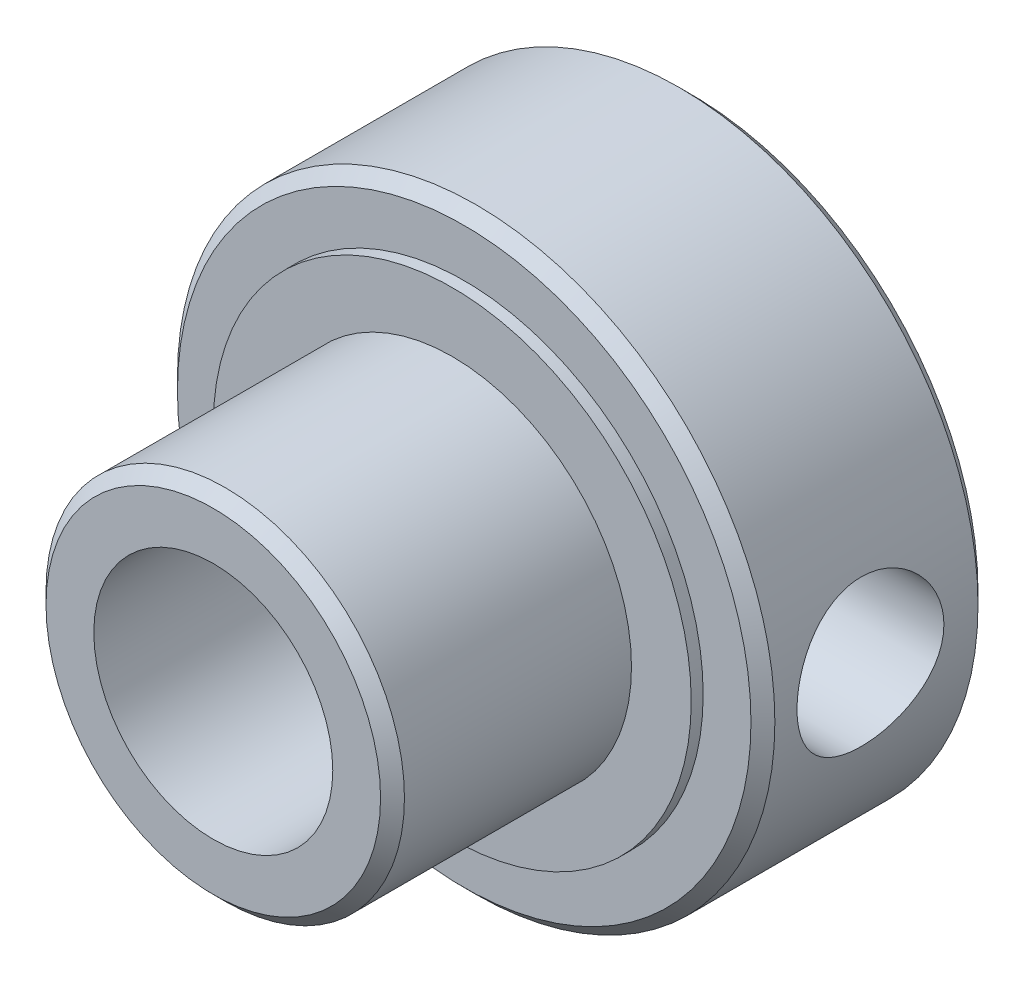
ISO-10303-21;
HEADER;
FILE_DESCRIPTION(('STEP AP214'),'2;1');
FILE_NAME('part.step','',(''),(''),'','','');
FILE_SCHEMA(('AUTOMOTIVE_DESIGN { 1 0 10303 214 1 1 1 1 }'));
ENDSEC;
DATA;
#1=APPLICATION_CONTEXT('core data for automotive mechanical design processes');
#2=APPLICATION_PROTOCOL_DEFINITION('international standard','automotive_design',2000,#1);
#3=PRODUCT_CONTEXT('',#1,'mechanical');
#4=PRODUCT('Part','Part','',(#3));
#5=PRODUCT_RELATED_PRODUCT_CATEGORY('part','',(#4));
#6=PRODUCT_DEFINITION_FORMATION('','',#4);
#7=PRODUCT_DEFINITION_CONTEXT('part definition',#1,'design');
#8=PRODUCT_DEFINITION('design','',#6,#7);
#9=PRODUCT_DEFINITION_SHAPE('','',#8);
#10=(LENGTH_UNIT() NAMED_UNIT(*) SI_UNIT(.MILLI.,.METRE.));
#11=(NAMED_UNIT(*) PLANE_ANGLE_UNIT() SI_UNIT($,.RADIAN.));
#12=(NAMED_UNIT(*) SI_UNIT($,.STERADIAN.) SOLID_ANGLE_UNIT());
#13=UNCERTAINTY_MEASURE_WITH_UNIT(LENGTH_MEASURE(1.E-05),#10,'distance_accuracy_value','');
#14=(GEOMETRIC_REPRESENTATION_CONTEXT(3) GLOBAL_UNCERTAINTY_ASSIGNED_CONTEXT((#13)) GLOBAL_UNIT_ASSIGNED_CONTEXT((#10,
#11,#12)) REPRESENTATION_CONTEXT('',''));
#15=CARTESIAN_POINT('',(0.,0.,0.));
#16=DIRECTION('',(0.,0.,1.));
#17=DIRECTION('',(1.,0.,0.));
#18=AXIS2_PLACEMENT_3D('',#15,#16,#17);
#19=CARTESIAN_POINT('',(0.,0.,8.));
#20=DIRECTION('',(0.,0.,-1.));
#21=DIRECTION('',(-1.,0.,0.));
#22=AXIS2_PLACEMENT_3D('',#19,#20,#21);
#23=CYLINDRICAL_SURFACE('',#22,3.);
#24=CARTESIAN_POINT('',(0.,0.,7.80000000003156));
#25=DIRECTION('',(0.,0.,-1.));
#26=DIRECTION('',(-1.,0.,0.));
#27=AXIS2_PLACEMENT_3D('',#24,#25,#26);
#28=CIRCLE('',#27,3.00000000004275);
#29=CARTESIAN_POINT('',(-3.00000000004275,0.,7.80000000003156));
#30=VERTEX_POINT('',#29);
#31=EDGE_CURVE('E45',#30,#30,#28,.F.);
#32=ORIENTED_EDGE('',*,*,#31,.F.);
#33=EDGE_LOOP('',(#32));
#34=FACE_BOUND('',#33,.T.);
#35=CARTESIAN_POINT('',(0.,0.,4.));
#36=DIRECTION('',(0.,0.,-1.));
#37=DIRECTION('',(-1.,0.,0.));
#38=AXIS2_PLACEMENT_3D('',#35,#36,#37);
#39=CIRCLE('',#38,3.);
#40=CARTESIAN_POINT('',(-3.,0.,4.));
#41=VERTEX_POINT('',#40);
#42=EDGE_CURVE('E18',#41,#41,#39,.F.);
#43=ORIENTED_EDGE('',*,*,#42,.T.);
#44=EDGE_LOOP('',(#43));
#45=FACE_BOUND('',#44,.T.);
#46=ADVANCED_FACE('F15',(#34,#45),#23,.T.);
#47=CARTESIAN_POINT('',(0.,0.,7.80000000003156));
#48=DIRECTION('',(0.,0.,-1.));
#49=DIRECTION('',(-1.,0.,0.));
#50=AXIS2_PLACEMENT_3D('',#47,#48,#49);
#51=CONICAL_SURFACE('',#50,3.00000000004275,0.785398163539557);
#52=CARTESIAN_POINT('',(0.,0.,8.0000000000382));
#53=DIRECTION('',(0.,0.,-1.));
#54=DIRECTION('',(-1.,0.,0.));
#55=AXIS2_PLACEMENT_3D('',#52,#53,#54);
#56=CIRCLE('',#55,2.79999999997926);
#57=CARTESIAN_POINT('',(-2.79999999997926,0.,8.0000000000382));
#58=VERTEX_POINT('',#57);
#59=EDGE_CURVE('E127',#58,#58,#56,.T.);
#60=ORIENTED_EDGE('',*,*,#59,.T.);
#61=EDGE_LOOP('',(#60));
#62=FACE_BOUND('',#61,.T.);
#63=ORIENTED_EDGE('',*,*,#31,.T.);
#64=EDGE_LOOP('',(#63));
#65=FACE_BOUND('',#64,.T.);
#66=ADVANCED_FACE('F116',(#62,#65),#51,.T.);
#67=CARTESIAN_POINT('',(0.,0.,4.));
#68=DIRECTION('',(0.,0.,-1.));
#69=DIRECTION('',(-1.,0.,0.));
#70=AXIS2_PLACEMENT_3D('',#67,#68,#69);
#71=PLANE('',#70);
#72=ORIENTED_EDGE('',*,*,#42,.F.);
#73=EDGE_LOOP('',(#72));
#74=FACE_BOUND('',#73,.T.);
#75=CARTESIAN_POINT('',(0.,0.,4.));
#76=DIRECTION('',(0.,0.,-1.));
#77=DIRECTION('',(-1.,0.,0.));
#78=AXIS2_PLACEMENT_3D('',#75,#76,#77);
#79=CIRCLE('',#78,4.);
#80=CARTESIAN_POINT('',(-4.,0.,4.));
#81=VERTEX_POINT('',#80);
#82=EDGE_CURVE('E132',#81,#81,#79,.T.);
#83=ORIENTED_EDGE('',*,*,#82,.F.);
#84=EDGE_LOOP('',(#83));
#85=FACE_BOUND('',#84,.T.);
#86=ADVANCED_FACE('F113',(#74,#85),#71,.F.);
#87=CARTESIAN_POINT('',(0.,0.,8.));
#88=DIRECTION('',(0.,0.,-1.));
#89=DIRECTION('',(-1.,0.,0.));
#90=AXIS2_PLACEMENT_3D('',#87,#88,#89);
#91=PLANE('',#90);
#92=CARTESIAN_POINT('',(0.,0.,8.));
#93=DIRECTION('',(0.,0.,1.));
#94=DIRECTION('',(1.,0.,0.));
#95=AXIS2_PLACEMENT_3D('',#92,#93,#94);
#96=CIRCLE('',#95,2.);
#97=CARTESIAN_POINT('',(2.,0.,8.));
#98=VERTEX_POINT('',#97);
#99=EDGE_CURVE('E42',#98,#98,#96,.F.);
#100=ORIENTED_EDGE('',*,*,#99,.T.);
#101=EDGE_LOOP('',(#100));
#102=FACE_BOUND('',#101,.T.);
#103=ORIENTED_EDGE('',*,*,#59,.F.);
#104=EDGE_LOOP('',(#103));
#105=FACE_BOUND('',#104,.T.);
#106=ADVANCED_FACE('F109',(#102,#105),#91,.F.);
#107=CARTESIAN_POINT('',(0.,0.,5.6843418860808E-11));
#108=DIRECTION('',(0.,0.,-1.));
#109=DIRECTION('',(-1.,0.,0.));
#110=AXIS2_PLACEMENT_3D('',#107,#108,#109);
#111=CONICAL_SURFACE('',#110,2.1999999999025,0.785398163397448);
#112=CARTESIAN_POINT('',(0.,0.,-5.6843418860808E-11));
#113=DIRECTION('',(0.,0.,-1.));
#114=DIRECTION('',(-1.,0.,0.));
#115=AXIS2_PLACEMENT_3D('',#112,#113,#114);
#116=CIRCLE('',#115,2.20000000001619);
#117=CARTESIAN_POINT('',(-2.20000000001619,0.,-5.6843418860808E-11));
#118=VERTEX_POINT('',#117);
#119=EDGE_CURVE('E134',#118,#118,#116,.F.);
#120=ORIENTED_EDGE('',*,*,#119,.F.);
#121=EDGE_LOOP('',(#120));
#122=FACE_BOUND('',#121,.T.);
#123=CARTESIAN_POINT('',(0.,0.,0.2));
#124=DIRECTION('',(0.,0.,1.));
#125=DIRECTION('',(1.,0.,0.));
#126=AXIS2_PLACEMENT_3D('',#123,#124,#125);
#127=CIRCLE('',#126,2.);
#128=CARTESIAN_POINT('',(2.,0.,0.2));
#129=VERTEX_POINT('',#128);
#130=EDGE_CURVE('E38',#129,#129,#127,.T.);
#131=ORIENTED_EDGE('',*,*,#130,.T.);
#132=EDGE_LOOP('',(#131));
#133=FACE_BOUND('',#132,.T.);
#134=ADVANCED_FACE('F105',(#122,#133),#111,.F.);
#135=CARTESIAN_POINT('',(0.,0.,4.));
#136=DIRECTION('',(0.,0.,-1.));
#137=DIRECTION('',(-1.,0.,0.));
#138=AXIS2_PLACEMENT_3D('',#135,#136,#137);
#139=CYLINDRICAL_SURFACE('',#138,4.);
#140=ORIENTED_EDGE('',*,*,#82,.T.);
#141=EDGE_LOOP('',(#140));
#142=FACE_BOUND('',#141,.T.);
#143=CARTESIAN_POINT('',(0.,0.,3.8));
#144=DIRECTION('',(0.,0.,-1.));
#145=DIRECTION('',(-1.,0.,0.));
#146=AXIS2_PLACEMENT_3D('',#143,#144,#145);
#147=CIRCLE('',#146,4.);
#148=CARTESIAN_POINT('',(-4.,0.,3.8));
#149=VERTEX_POINT('',#148);
#150=EDGE_CURVE('E41',#149,#149,#147,.F.);
#151=ORIENTED_EDGE('',*,*,#150,.T.);
#152=EDGE_LOOP('',(#151));
#153=FACE_BOUND('',#152,.T.);
#154=ADVANCED_FACE('F101',(#142,#153),#139,.T.);
#155=CARTESIAN_POINT('',(0.,0.,0.));
#156=DIRECTION('',(0.,0.,-1.));
#157=DIRECTION('',(-1.,0.,0.));
#158=AXIS2_PLACEMENT_3D('',#155,#156,#157);
#159=PLANE('',#158);
#160=ORIENTED_EDGE('',*,*,#119,.T.);
#161=EDGE_LOOP('',(#160));
#162=FACE_BOUND('',#161,.T.);
#163=CARTESIAN_POINT('',(0.,0.,0.));
#164=DIRECTION('',(0.,0.,1.));
#165=DIRECTION('',(1.,0.,0.));
#166=AXIS2_PLACEMENT_3D('',#163,#164,#165);
#167=CIRCLE('',#166,4.80000000004566);
#168=CARTESIAN_POINT('',(4.80000000004566,0.,0.));
#169=VERTEX_POINT('',#168);
#170=EDGE_CURVE('E142',#169,#169,#167,.T.);
#171=ORIENTED_EDGE('',*,*,#170,.F.);
#172=EDGE_LOOP('',(#171));
#173=FACE_BOUND('',#172,.T.);
#174=ADVANCED_FACE('F95',(#162,#173),#159,.T.);
#175=CARTESIAN_POINT('',(0.,0.,0.));
#176=DIRECTION('',(0.,0.,1.));
#177=DIRECTION('',(1.,0.,0.));
#178=AXIS2_PLACEMENT_3D('',#175,#176,#177);
#179=CYLINDRICAL_SURFACE('',#178,2.);
#180=ORIENTED_EDGE('',*,*,#130,.F.);
#181=EDGE_LOOP('',(#180));
#182=FACE_BOUND('',#181,.T.);
#183=CARTESIAN_POINT('',(-1.57744405606031,1.2295,2.));
#184=CARTESIAN_POINT('',(-1.57745678911594,1.22949129816767,1.93862327472534));
#185=CARTESIAN_POINT('',(-1.58109196100442,1.22486385440479,1.87716984818467));
#186=CARTESIAN_POINT('',(-1.59501755630961,1.20666411441676,1.75628838737712));
#187=CARTESIAN_POINT('',(-1.60532735124577,1.19306578010795,1.69686678015674));
#188=CARTESIAN_POINT('',(-1.63088700444535,1.15787376811103,1.58218630404039));
#189=CARTESIAN_POINT('',(-1.6460951204872,1.13634743593746,1.52689695966884));
#190=CARTESIAN_POINT('',(-1.6796676343417,1.0861066352902,1.42078231879187));
#191=CARTESIAN_POINT('',(-1.69803192457588,1.05739241180121,1.36995687022336));
#192=CARTESIAN_POINT('',(-1.73871375203377,0.989263826834141,1.26698209754321));
#193=CARTESIAN_POINT('',(-1.76123545056959,0.948946118250219,1.21551087993918));
#194=CARTESIAN_POINT('',(-1.80605212953378,0.860600601444288,1.11949011888002));
#195=CARTESIAN_POINT('',(-1.82834690143186,0.812566281803561,1.07494648407854));
#196=CARTESIAN_POINT('',(-1.87324158388311,0.703442620355481,0.988960950801901));
#197=CARTESIAN_POINT('',(-1.89558026851494,0.641486599001158,0.948468904104381));
#198=CARTESIAN_POINT('',(-1.93509376441328,0.51000655466902,0.8788036518289));
#199=CARTESIAN_POINT('',(-1.95227354246349,0.44048989918581,0.849619551512));
#200=CARTESIAN_POINT('',(-1.97800317203967,0.303134878364585,0.806503395661004));
#201=CARTESIAN_POINT('',(-1.98723958615293,0.235813034511381,0.791346372147134));
#202=CARTESIAN_POINT('',(-1.99872189243648,0.0990169586131426,0.772556359497417));
#203=CARTESIAN_POINT('',(-2.00097480800734,0.0295449600956503,0.768911792055772));
#204=CARTESIAN_POINT('',(-1.99841731545911,-0.0998275313360785,0.77307689409452));
#205=CARTESIAN_POINT('',(-1.99448691083817,-0.159798445440171,0.779459356253932));
#206=CARTESIAN_POINT('',(-1.98152367890593,-0.277625594025964,0.800759411960436));
#207=CARTESIAN_POINT('',(-1.97249046603257,-0.335481668361162,0.815677650461634));
#208=CARTESIAN_POINT('',(-1.95005280813396,-0.447879263833968,0.853436952436569));
#209=CARTESIAN_POINT('',(-1.93663120609503,-0.502406762076722,0.876309135643518));
#210=CARTESIAN_POINT('',(-1.90647072583226,-0.606902727246256,0.929126338392296));
#211=CARTESIAN_POINT('',(-1.88973104979055,-0.656870093479041,0.959073059311792));
#212=CARTESIAN_POINT('',(-1.85191345438998,-0.757391018790714,1.0293114553596));
#213=CARTESIAN_POINT('',(-1.83055530766701,-0.807266940396607,1.07042090214006));
#214=CARTESIAN_POINT('',(-1.78687019341437,-0.899845465866671,1.15970671570248));
#215=CARTESIAN_POINT('',(-1.76454188621062,-0.942537726532271,1.20789308831154));
#216=CARTESIAN_POINT('',(-1.71814471262741,-1.02492857271023,1.31704002593007));
#217=CARTESIAN_POINT('',(-1.69420534380106,-1.06359233816948,1.3788440979202));
#218=CARTESIAN_POINT('',(-1.65078946261475,-1.12980906654754,1.50954834660789));
#219=CARTESIAN_POINT('',(-1.63130472260524,-1.15738258576187,1.57843509472482));
#220=CARTESIAN_POINT('',(-1.60426667835489,-1.19445111213129,1.7032842681818));
#221=CARTESIAN_POINT('',(-1.59493418917378,-1.20677059138659,1.75802123041804));
#222=CARTESIAN_POINT('',(-1.58189014711593,-1.2238233943651,1.86929405232716));
#223=CARTESIAN_POINT('',(-1.57817139747671,-1.22856643147224,1.92582751375218));
#224=CARTESIAN_POINT('',(-1.57691071516388,-1.23018464678284,2.03918466485333));
#225=CARTESIAN_POINT('',(-1.57938047907224,-1.22704492618097,2.09600870123023));
#226=CARTESIAN_POINT('',(-1.59013578127866,-1.21307119163926,2.20815299852041));
#227=CARTESIAN_POINT('',(-1.59842606204698,-1.20223090330682,2.26347199494404));
#228=CARTESIAN_POINT('',(-1.61957067933036,-1.17358413601077,2.37070788292469));
#229=CARTESIAN_POINT('',(-1.63237918974629,-1.15584742572029,2.42265295020391));
#230=CARTESIAN_POINT('',(-1.66117926768073,-1.11405845159863,2.52297293300902));
#231=CARTESIAN_POINT('',(-1.67717198969405,-1.09000389610333,2.57134654489199));
#232=CARTESIAN_POINT('',(-1.71413582816139,-1.03109616094986,2.67272570703481));
#233=CARTESIAN_POINT('',(-1.73547910229229,-0.995065617001666,2.72491189127304));
#234=CARTESIAN_POINT('',(-1.77871166412294,-0.915552940010495,2.8230602462308));
#235=CARTESIAN_POINT('',(-1.8006014836699,-0.872063286128103,2.86901605044908));
#236=CARTESIAN_POINT('',(-1.8462582692219,-0.771247546458067,2.96027254092492));
#237=CARTESIAN_POINT('',(-1.86982609266311,-0.712826806942201,3.00447745002077));
#238=CARTESIAN_POINT('',(-1.91277177539386,-0.587924276254584,3.08232096647923));
#239=CARTESIAN_POINT('',(-1.93215197420124,-0.521447018624589,3.11596547844381));
#240=CARTESIAN_POINT('',(-1.96340037956906,-0.386679810059874,3.16920659210321));
#241=CARTESIAN_POINT('',(-1.97567858906626,-0.3187961553614,3.18958114695527));
#242=CARTESIAN_POINT('',(-1.99313977098263,-0.179682409453529,3.21836406874047));
#243=CARTESIAN_POINT('',(-1.99833180269835,-0.108456711662429,3.22678771481227));
#244=CARTESIAN_POINT('',(-2.0007956794868,0.0243271839361221,3.23079302355575));
#245=CARTESIAN_POINT('',(-1.9990865460224,0.0858235312880884,3.22802684861112));
#246=CARTESIAN_POINT('',(-1.99015765933028,0.207315804832012,3.21343794322687));
#247=CARTESIAN_POINT('',(-1.98293801193347,0.267311759816555,3.20161538671748));
#248=CARTESIAN_POINT('',(-1.96391362655646,0.382583838978315,3.16994929862459));
#249=CARTESIAN_POINT('',(-1.95223625291952,0.437943149677368,3.15032799947778));
#250=CARTESIAN_POINT('',(-1.92522269034558,0.544559850167598,3.10386117991073));
#251=CARTESIAN_POINT('',(-1.90988581777033,0.595816471135034,3.07701430954716));
#252=CARTESIAN_POINT('',(-1.87486826328596,0.698658887621749,3.01369176725178));
#253=CARTESIAN_POINT('',(-1.85489928869421,0.749701972830717,2.97649646594693));
#254=CARTESIAN_POINT('',(-1.81337949825883,0.845205784336456,2.89512055109483));
#255=CARTESIAN_POINT('',(-1.79182687592161,0.889658813273182,2.85093189169828));
#256=CARTESIAN_POINT('',(-1.74590187101613,0.977026620513429,2.74976834336977));
#257=CARTESIAN_POINT('',(-1.72154921562413,1.0188896045663,2.69187079688179));
#258=CARTESIAN_POINT('',(-1.67588742315706,1.09237169614615,2.56878646677064));
#259=CARTESIAN_POINT('',(-1.65457620981867,1.12399781083199,2.50360471049229));
#260=CARTESIAN_POINT('',(-1.62231061956659,1.16992034913229,2.38233109204092));
#261=CARTESIAN_POINT('',(-1.61010704960292,1.18650632594188,2.32743989408076));
#262=CARTESIAN_POINT('',(-1.59108854247315,1.21189870973305,2.21508607348622));
#263=CARTESIAN_POINT('',(-1.58425602911251,1.22073050261677,2.15763249376479));
#264=CARTESIAN_POINT('',(-1.57849659268363,1.22814980277432,2.06657888823344));
#265=CARTESIAN_POINT('',(-1.57743714757682,1.22950472129131,2.03330073356482));
#266=CARTESIAN_POINT('',(-1.57744405606031,1.2295,2.));
#267=B_SPLINE_CURVE_WITH_KNOTS('',3,(#183,#184,#185,#186,#187,#188,#189,#190,#191,#192,#193,
#194,#195,#196,#197,#198,#199,#200,#201,#202,#203,#204,#205,#206,#207,#208,#209,#210,#211,#212,
#213,#214,#215,#216,#217,#218,#219,#220,#221,#222,#223,#224,#225,#226,#227,#228,#229,#230,#231,
#232,#233,#234,#235,#236,#237,#238,#239,#240,#241,#242,#243,#244,#245,#246,#247,#248,#249,#250,
#251,#252,#253,#254,#255,#256,#257,#258,#259,#260,#261,#262,#263,#264,#265,#266),.UNSPECIFIED.,
.T.,.F.,(4,2,2,2,2,2,2,2,2,2,2,2,2,2,2,2,2,2,2,2,2,2,2,2,2,2,2,2,2,2,2,2,2,2,2,2,2,2,2,2,2,4),
(0.,0.184001804395042,0.368540039232677,0.551545543300876,0.73454481084705,0.941199052572206,
1.14802859785574,1.37870643240914,1.60916146246839,1.81677591992826,2.02418150881425,
2.20462931191463,2.38509075125837,2.56626633900064,2.74748554266203,2.95089824131252,
3.15460135753852,3.38367099531554,3.61231406302197,3.78222523055623,3.95191838799773,
4.12193251532795,4.29208532863424,4.46055976821653,4.62909540292258,4.82907147051622,
5.02925036735733,5.25894609039044,5.48851315464674,5.70299213831715,5.9171966645012,
6.10101581179819,6.28483142888784,6.46374672787186,6.64269547658146,6.84064135918627,
7.03881665636777,7.26423882076511,7.48950635529191,7.664694177088,7.83930630137879,
7.93913885249951),.UNSPECIFIED.);
#268=CARTESIAN_POINT('',(-1.57744405606031,1.2295,2.));
#269=VERTEX_POINT('',#268);
#270=EDGE_CURVE('E80',#269,#269,#267,.T.);
#271=ORIENTED_EDGE('',*,*,#270,.T.);
#272=EDGE_LOOP('',(#271));
#273=FACE_BOUND('',#272,.T.);
#274=CARTESIAN_POINT('',(1.57744405606031,1.2295,2.));
#275=CARTESIAN_POINT('',(1.57745678911594,1.22949129816767,2.06137672527466));
#276=CARTESIAN_POINT('',(1.58109196100442,1.22486385440479,2.12283015181533));
#277=CARTESIAN_POINT('',(1.59501755630961,1.20666411441676,2.24371161262288));
#278=CARTESIAN_POINT('',(1.60532735124577,1.19306578010795,2.30313321984326));
#279=CARTESIAN_POINT('',(1.63088700444535,1.15787376811103,2.41781369595961));
#280=CARTESIAN_POINT('',(1.6460951204872,1.13634743593746,2.47310304033116));
#281=CARTESIAN_POINT('',(1.6796676343417,1.0861066352902,2.57921768120813));
#282=CARTESIAN_POINT('',(1.69803192457588,1.05739241180121,2.63004312977664));
#283=CARTESIAN_POINT('',(1.73871375203377,0.989263826834141,2.73301790245679));
#284=CARTESIAN_POINT('',(1.76123545056959,0.948946118250219,2.78448912006082));
#285=CARTESIAN_POINT('',(1.80605212953378,0.860600601444288,2.88050988111998));
#286=CARTESIAN_POINT('',(1.82834690143186,0.812566281803561,2.92505351592146));
#287=CARTESIAN_POINT('',(1.87324158388311,0.70344262035548,3.0110390491981));
#288=CARTESIAN_POINT('',(1.89558026851494,0.641486599001158,3.05153109589562));
#289=CARTESIAN_POINT('',(1.93509376441328,0.51000655466902,3.1211963481711));
#290=CARTESIAN_POINT('',(1.95227354246349,0.44048989918581,3.150380448488));
#291=CARTESIAN_POINT('',(1.97800317203967,0.303134878364585,3.193496604339));
#292=CARTESIAN_POINT('',(1.98723958615293,0.235813034511382,3.20865362785287));
#293=CARTESIAN_POINT('',(1.99872189243648,0.0990169586131429,3.22744364050258));
#294=CARTESIAN_POINT('',(2.00097480800734,0.0295449600956507,3.23108820794423));
#295=CARTESIAN_POINT('',(1.99841731545911,-0.0998275313360781,3.22692310590548));
#296=CARTESIAN_POINT('',(1.99448691083817,-0.15979844544017,3.22054064374607));
#297=CARTESIAN_POINT('',(1.98152367890593,-0.277625594025963,3.19924058803956));
#298=CARTESIAN_POINT('',(1.97249046603257,-0.335481668361162,3.18432234953837));
#299=CARTESIAN_POINT('',(1.95005280813396,-0.447879263833967,3.14656304756343));
#300=CARTESIAN_POINT('',(1.93663120609503,-0.502406762076722,3.12369086435648));
#301=CARTESIAN_POINT('',(1.90647072583226,-0.606902727246256,3.0708736616077));
#302=CARTESIAN_POINT('',(1.88973104979055,-0.656870093479041,3.04092694068821));
#303=CARTESIAN_POINT('',(1.85191345438998,-0.757391018790714,2.9706885446404));
#304=CARTESIAN_POINT('',(1.83055530766701,-0.807266940396607,2.92957909785994));
#305=CARTESIAN_POINT('',(1.78687019341437,-0.89984546586667,2.84029328429752));
#306=CARTESIAN_POINT('',(1.76454188621063,-0.94253772653227,2.79210691168846));
#307=CARTESIAN_POINT('',(1.71814471262741,-1.02492857271023,2.68295997406993));
#308=CARTESIAN_POINT('',(1.69420534380106,-1.06359233816948,2.6211559020798));
#309=CARTESIAN_POINT('',(1.65078946261475,-1.12980906654754,2.49045165339211));
#310=CARTESIAN_POINT('',(1.63130472260524,-1.15738258576187,2.42156490527518));
#311=CARTESIAN_POINT('',(1.60426667835489,-1.19445111213129,2.2967157318182));
#312=CARTESIAN_POINT('',(1.59493418917378,-1.20677059138659,2.24197876958196));
#313=CARTESIAN_POINT('',(1.58189014711593,-1.2238233943651,2.13070594767284));
#314=CARTESIAN_POINT('',(1.57817139747671,-1.22856643147224,2.07417248624782));
#315=CARTESIAN_POINT('',(1.57691071516388,-1.23018464678284,1.96081533514667));
#316=CARTESIAN_POINT('',(1.57938047907224,-1.22704492618097,1.90399129876977));
#317=CARTESIAN_POINT('',(1.59013578127866,-1.21307119163926,1.79184700147959));
#318=CARTESIAN_POINT('',(1.59842606204698,-1.20223090330682,1.73652800505596));
#319=CARTESIAN_POINT('',(1.61957067933036,-1.17358413601077,1.62929211707531));
#320=CARTESIAN_POINT('',(1.63237918974629,-1.15584742572029,1.57734704979609));
#321=CARTESIAN_POINT('',(1.66117926768073,-1.11405845159863,1.47702706699098));
#322=CARTESIAN_POINT('',(1.67717198969405,-1.09000389610333,1.42865345510801));
#323=CARTESIAN_POINT('',(1.71413582816139,-1.03109616094986,1.32727429296519));
#324=CARTESIAN_POINT('',(1.73547910229229,-0.995065617001666,1.27508810872696));
#325=CARTESIAN_POINT('',(1.77871166412294,-0.915552940010495,1.1769397537692));
#326=CARTESIAN_POINT('',(1.8006014836699,-0.872063286128103,1.13098394955092));
#327=CARTESIAN_POINT('',(1.8462582692219,-0.771247546458066,1.03972745907508));
#328=CARTESIAN_POINT('',(1.86982609266311,-0.7128268069422,0.995522549979227));
#329=CARTESIAN_POINT('',(1.91277177539386,-0.587924276254583,0.917679033520768));
#330=CARTESIAN_POINT('',(1.93215197420124,-0.521447018624588,0.884034521556191));
#331=CARTESIAN_POINT('',(1.96340037956906,-0.386679810059873,0.830793407896791));
#332=CARTESIAN_POINT('',(1.97567858906626,-0.318796155361401,0.810418853044727));
#333=CARTESIAN_POINT('',(1.99313977098263,-0.179682409453529,0.781635931259535));
#334=CARTESIAN_POINT('',(1.99833180269835,-0.108456711662429,0.773212285187732));
#335=CARTESIAN_POINT('',(2.0007956794868,0.0243271839361224,0.769206976444252));
#336=CARTESIAN_POINT('',(1.9990865460224,0.0858235312880888,0.771973151388881));
#337=CARTESIAN_POINT('',(1.99015765933028,0.207315804832012,0.786562056773129));
#338=CARTESIAN_POINT('',(1.98293801193347,0.267311759816555,0.798384613282519));
#339=CARTESIAN_POINT('',(1.96391362655646,0.382583838978316,0.830050701375407));
#340=CARTESIAN_POINT('',(1.95223625291952,0.437943149677368,0.849672000522218));
#341=CARTESIAN_POINT('',(1.92522269034558,0.544559850167598,0.896138820089275));
#342=CARTESIAN_POINT('',(1.90988581777033,0.595816471135034,0.922985690452845));
#343=CARTESIAN_POINT('',(1.87486826328596,0.698658887621749,0.986308232748216));
#344=CARTESIAN_POINT('',(1.85489928869421,0.749701972830718,1.02350353405307));
#345=CARTESIAN_POINT('',(1.81337949825883,0.845205784336456,1.10487944890517));
#346=CARTESIAN_POINT('',(1.79182687592161,0.889658813273182,1.14906810830172));
#347=CARTESIAN_POINT('',(1.74590187101613,0.977026620513429,1.25023165663024));
#348=CARTESIAN_POINT('',(1.72154921562413,1.0188896045663,1.30812920311821));
#349=CARTESIAN_POINT('',(1.67588742315706,1.09237169614615,1.43121353322936));
#350=CARTESIAN_POINT('',(1.65457620981867,1.12399781083199,1.49639528950771));
#351=CARTESIAN_POINT('',(1.62231061956659,1.16992034913229,1.61766890795908));
#352=CARTESIAN_POINT('',(1.61010704960292,1.18650632594188,1.67256010591924));
#353=CARTESIAN_POINT('',(1.59108854247315,1.21189870973305,1.78491392651378));
#354=CARTESIAN_POINT('',(1.58425602911251,1.22073050261677,1.84236750623521));
#355=CARTESIAN_POINT('',(1.57849659268363,1.22814980277432,1.93342111176656));
#356=CARTESIAN_POINT('',(1.57743714757682,1.22950472129131,1.96669926643518));
#357=CARTESIAN_POINT('',(1.57744405606031,1.2295,2.));
#358=B_SPLINE_CURVE_WITH_KNOTS('',3,(#274,#275,#276,#277,#278,#279,#280,#281,#282,#283,#284,
#285,#286,#287,#288,#289,#290,#291,#292,#293,#294,#295,#296,#297,#298,#299,#300,#301,#302,#303,
#304,#305,#306,#307,#308,#309,#310,#311,#312,#313,#314,#315,#316,#317,#318,#319,#320,#321,#322,
#323,#324,#325,#326,#327,#328,#329,#330,#331,#332,#333,#334,#335,#336,#337,#338,#339,#340,#341,
#342,#343,#344,#345,#346,#347,#348,#349,#350,#351,#352,#353,#354,#355,#356,#357),.UNSPECIFIED.,
.T.,.F.,(4,2,2,2,2,2,2,2,2,2,2,2,2,2,2,2,2,2,2,2,2,2,2,2,2,2,2,2,2,2,2,2,2,2,2,2,2,2,2,2,2,4),
(0.,0.184001804395042,0.368540039232677,0.551545543300876,0.734544810847049,0.941199052572206,
1.14802859785574,1.37870643240914,1.60916146246839,1.81677591992826,2.02418150881425,
2.20462931191463,2.38509075125837,2.56626633900064,2.74748554266203,2.95089824131252,
3.15460135753852,3.38367099531554,3.61231406302197,3.78222523055624,3.95191838799773,
4.12193251532796,4.29208532863425,4.46055976821653,4.62909540292258,4.82907147051622,
5.02925036735733,5.25894609039044,5.48851315464674,5.70299213831715,5.9171966645012,
6.10101581179819,6.28483142888784,6.46374672787186,6.64269547658146,6.84064135918627,
7.03881665636777,7.26423882076511,7.48950635529191,7.664694177088,7.83930630137879,
7.93913885249951),.UNSPECIFIED.);
#359=CARTESIAN_POINT('',(1.57744405606031,1.2295,2.));
#360=VERTEX_POINT('',#359);
#361=EDGE_CURVE('E78',#360,#360,#358,.T.);
#362=ORIENTED_EDGE('',*,*,#361,.T.);
#363=EDGE_LOOP('',(#362));
#364=FACE_BOUND('',#363,.T.);
#365=ORIENTED_EDGE('',*,*,#99,.F.);
#366=EDGE_LOOP('',(#365));
#367=FACE_BOUND('',#366,.T.);
#368=ADVANCED_FACE('F89',(#182,#273,#364,#367),#179,.F.);
#369=CARTESIAN_POINT('',(0.,0.,3.8));
#370=DIRECTION('',(0.,0.,-1.));
#371=DIRECTION('',(-1.,0.,0.));
#372=AXIS2_PLACEMENT_3D('',#369,#370,#371);
#373=PLANE('',#372);
#374=ORIENTED_EDGE('',*,*,#150,.F.);
#375=EDGE_LOOP('',(#374));
#376=FACE_BOUND('',#375,.T.);
#377=CARTESIAN_POINT('',(0.,0.,3.79999999995562));
#378=DIRECTION('',(0.,0.,-1.));
#379=DIRECTION('',(-1.,0.,0.));
#380=AXIS2_PLACEMENT_3D('',#377,#378,#379);
#381=CIRCLE('',#380,4.80000000004566);
#382=CARTESIAN_POINT('',(-4.80000000004566,0.,3.79999999995562));
#383=VERTEX_POINT('',#382);
#384=EDGE_CURVE('E35',#383,#383,#381,.T.);
#385=ORIENTED_EDGE('',*,*,#384,.F.);
#386=EDGE_LOOP('',(#385));
#387=FACE_BOUND('',#386,.T.);
#388=ADVANCED_FACE('F94',(#376,#387),#373,.F.);
#389=CARTESIAN_POINT('',(0.,0.,0.199999999836109));
#390=DIRECTION('',(0.,0.,1.));
#391=DIRECTION('',(1.,0.,0.));
#392=AXIS2_PLACEMENT_3D('',#389,#390,#391);
#393=CONICAL_SURFACE('',#392,4.99999999988177,0.785398163397448);
#394=ORIENTED_EDGE('',*,*,#170,.T.);
#395=EDGE_LOOP('',(#394));
#396=FACE_BOUND('',#395,.T.);
#397=CARTESIAN_POINT('',(0.,0.,0.2));
#398=DIRECTION('',(0.,0.,1.));
#399=DIRECTION('',(1.,0.,0.));
#400=AXIS2_PLACEMENT_3D('',#397,#398,#399);
#401=CIRCLE('',#400,5.);
#402=CARTESIAN_POINT('',(5.,0.,0.2));
#403=VERTEX_POINT('',#402);
#404=EDGE_CURVE('E32',#403,#403,#401,.T.);
#405=ORIENTED_EDGE('',*,*,#404,.F.);
#406=EDGE_LOOP('',(#405));
#407=FACE_BOUND('',#406,.T.);
#408=ADVANCED_FACE('F153',(#396,#407),#393,.T.);
#409=CARTESIAN_POINT('',(-4.,0.,2.));
#410=DIRECTION('',(1.,0.,0.));
#411=DIRECTION('',(0.,0.,-1.));
#412=AXIS2_PLACEMENT_3D('',#409,#410,#411);
#413=CYLINDRICAL_SURFACE('',#412,1.2295);
#414=ORIENTED_EDGE('',*,*,#270,.F.);
#415=EDGE_LOOP('',(#414));
#416=FACE_BOUND('',#415,.T.);
#417=CARTESIAN_POINT('',(-4.84647601355872,1.2295,2.));
#418=CARTESIAN_POINT('',(-4.84647733029344,1.22949800740905,2.06793170933259));
#419=CARTESIAN_POINT('',(-4.84791987524439,1.22385083329861,2.13588571418358));
#420=CARTESIAN_POINT('',(-4.85352003560886,1.20144577752489,2.26984492965321));
#421=CARTESIAN_POINT('',(-4.85767928343361,1.18468121555794,2.33584894362223));
#422=CARTESIAN_POINT('',(-4.8682139510427,1.14061463698044,2.46395115989363));
#423=CARTESIAN_POINT('',(-4.87458656878191,1.11332593874222,2.52605418387839));
#424=CARTESIAN_POINT('',(-4.88882647282933,1.04902597047154,2.64480670488638));
#425=CARTESIAN_POINT('',(-4.89669380985644,1.01201437050466,2.70145601675561));
#426=CARTESIAN_POINT('',(-4.91322421638227,0.928477523767523,2.80889952675478));
#427=CARTESIAN_POINT('',(-4.92189966019809,0.881783316820237,2.85956048093604));
#428=CARTESIAN_POINT('',(-4.93896129883955,0.780570781100806,2.95241629960626));
#429=CARTESIAN_POINT('',(-4.94734746723208,0.726051739656115,2.99461039210757));
#430=CARTESIAN_POINT('',(-4.96302228122301,0.609826966345177,3.06987741506014));
#431=CARTESIAN_POINT('',(-4.97029462111351,0.548034319660792,3.10281982398919));
#432=CARTESIAN_POINT('',(-4.98278140223866,0.419580105733765,3.15780029542473));
#433=CARTESIAN_POINT('',(-4.98799613691012,0.352919234360784,3.17983991290128));
#434=CARTESIAN_POINT('',(-4.99569267496242,0.218009449283475,3.2119634503991));
#435=CARTESIAN_POINT('',(-4.99822611050071,0.14981738600697,3.22227354240355));
#436=CARTESIAN_POINT('',(-5.00045438344667,0.0126276224954327,3.23135491757474));
#437=CARTESIAN_POINT('',(-5.0001496274147,-0.0563699609376621,3.23012785339584));
#438=CARTESIAN_POINT('',(-4.99677443180312,-0.191644860912023,3.21633321621147));
#439=CARTESIAN_POINT('',(-4.99376352028065,-0.257948775665949,3.20400972379789));
#440=CARTESIAN_POINT('',(-4.98538342309394,-0.387517167157121,3.16876390989455));
#441=CARTESIAN_POINT('',(-4.98001411422585,-0.450781484912722,3.14584103468441));
#442=CARTESIAN_POINT('',(-4.9674288088643,-0.573122636597325,3.08984716142227));
#443=CARTESIAN_POINT('',(-4.96019695776629,-0.632157662316612,3.05668852629455));
#444=CARTESIAN_POINT('',(-4.94467223682587,-0.743911464018326,2.98123069686024));
#445=CARTESIAN_POINT('',(-4.93637918788028,-0.79662917088306,2.93892995876725));
#446=CARTESIAN_POINT('',(-4.91938054116651,-0.89570710125311,2.84507733362629));
#447=CARTESIAN_POINT('',(-4.91066982733715,-0.941864555632882,2.7933120914242));
#448=CARTESIAN_POINT('',(-4.8940170863293,-1.02488772335992,2.68268468129646));
#449=CARTESIAN_POINT('',(-4.88607509273102,-1.06175303090846,2.62382220359228));
#450=CARTESIAN_POINT('',(-4.87184128503363,-1.12526961029378,2.50028324309525));
#451=CARTESIAN_POINT('',(-4.86555716144317,-1.15187353621208,2.43558147072478));
#452=CARTESIAN_POINT('',(-4.85545015723567,-1.19376427090762,2.30243226814762));
#453=CARTESIAN_POINT('',(-4.85162676931803,-1.20905341241683,2.23398561313787));
#454=CARTESIAN_POINT('',(-4.84698021296344,-1.22754721608015,2.09716624216566));
#455=CARTESIAN_POINT('',(-4.8460827863185,-1.2310510529063,2.0288364395519));
#456=CARTESIAN_POINT('',(-4.8471878795408,-1.22669259107833,1.89256851865319));
#457=CARTESIAN_POINT('',(-4.84919014208253,-1.21883130099352,1.82463036614939));
#458=CARTESIAN_POINT('',(-4.85579799129104,-1.19222769906888,1.69217547667522));
#459=CARTESIAN_POINT('',(-4.86036218859231,-1.17365825566198,1.62762175814052));
#460=CARTESIAN_POINT('',(-4.87154061173663,-1.12635650293813,1.5025431364899));
#461=CARTESIAN_POINT('',(-4.87815507427921,-1.09762302014649,1.44201869952806));
#462=CARTESIAN_POINT('',(-4.89284602759634,-1.03017812713158,1.32544533752391));
#463=CARTESIAN_POINT('',(-4.90094796521383,-0.991287097071036,1.26950361085147));
#464=CARTESIAN_POINT('',(-4.91763792724511,-0.904859277067489,1.16483041957679));
#465=CARTESIAN_POINT('',(-4.92622602867692,-0.857321114591981,1.11610010184921));
#466=CARTESIAN_POINT('',(-4.94317137798489,-0.753578056318647,1.02602813590776));
#467=CARTESIAN_POINT('',(-4.9515180619443,-0.69719178141134,0.984893043266547));
#468=CARTESIAN_POINT('',(-4.96682526409042,-0.578137849913339,0.912676141802464));
#469=CARTESIAN_POINT('',(-4.97378585389674,-0.515470518117101,0.88159381350051));
#470=CARTESIAN_POINT('',(-4.98549314382512,-0.386062690482358,0.830630161211616));
#471=CARTESIAN_POINT('',(-4.99025552522031,-0.319355010638868,0.810669281826297));
#472=CARTESIAN_POINT('',(-4.99709835166159,-0.183399939922036,0.782274744490979));
#473=CARTESIAN_POINT('',(-4.99917929635533,-0.114153024673081,0.773838938989447));
#474=CARTESIAN_POINT('',(-5.00040515286136,0.0229716766950699,0.768851512602517));
#475=CARTESIAN_POINT('',(-4.99962549073514,0.0908378556933469,0.771994598281218));
#476=CARTESIAN_POINT('',(-4.99538421515166,0.225043418460818,0.789378734790666));
#477=CARTESIAN_POINT('',(-4.99192267676017,0.291382844910333,0.803619474997894));
#478=CARTESIAN_POINT('',(-4.98271744157992,0.420343630021147,0.842633187377966));
#479=CARTESIAN_POINT('',(-4.97698536527459,0.482982082713007,0.867352574944378));
#480=CARTESIAN_POINT('',(-4.9638437514236,0.603257520099533,0.9265729644717));
#481=CARTESIAN_POINT('',(-4.9564340085718,0.660893891464301,0.961075163744544));
#482=CARTESIAN_POINT('',(-4.94052165608653,0.770982631598162,1.03982177480302));
#483=CARTESIAN_POINT('',(-4.93199760955278,0.823282967322134,1.08427440331984));
#484=CARTESIAN_POINT('',(-4.91491623382841,0.919785523540132,1.18125356271453));
#485=CARTESIAN_POINT('',(-4.90635889680751,0.963985704367842,1.2337821210522));
#486=CARTESIAN_POINT('',(-4.89000601098268,1.0438079285324,1.34655340206109));
#487=CARTESIAN_POINT('',(-4.88222683153778,1.07926234194636,1.40691733113451));
#488=CARTESIAN_POINT('',(-4.86852908387159,1.13946682016973,1.53293083328211));
#489=CARTESIAN_POINT('',(-4.86260913137073,1.16422485410737,1.59857642794876));
#490=CARTESIAN_POINT('',(-4.85424924997674,1.19854457173104,1.72011174180057));
#491=CARTESIAN_POINT('',(-4.8513558492896,1.21012799356841,1.77540804297933));
#492=CARTESIAN_POINT('',(-4.84746875944393,1.22560623041608,1.88713115901014));
#493=CARTESIAN_POINT('',(-4.84647491952921,1.22950165557515,1.94355788378838));
#494=CARTESIAN_POINT('',(-4.84647601355872,1.2295,2.));
#495=B_SPLINE_CURVE_WITH_KNOTS('',3,(#417,#418,#419,#420,#421,#422,#423,#424,#425,#426,#427,
#428,#429,#430,#431,#432,#433,#434,#435,#436,#437,#438,#439,#440,#441,#442,#443,#444,#445,#446,
#447,#448,#449,#450,#451,#452,#453,#454,#455,#456,#457,#458,#459,#460,#461,#462,#463,#464,#465,
#466,#467,#468,#469,#470,#471,#472,#473,#474,#475,#476,#477,#478,#479,#480,#481,#482,#483,#484,
#485,#486,#487,#488,#489,#490,#491,#492,#493,#494),.UNSPECIFIED.,.T.,.F.,(4,2,2,2,2,2,2,2,2,2,2,
2,2,2,2,2,2,2,2,2,2,2,2,2,2,2,2,2,2,2,2,2,2,2,2,2,2,2,4),(0.,0.203587915993848,
0.407298276482464,0.610751681488736,0.814211991321776,1.02157728378855,1.22896147473079,
1.43913920624116,1.64928695328635,1.85530998665434,2.06130350844503,2.26287373027233,
2.46445448348177,2.66781139684473,2.87120267705708,3.07992315490755,3.28865274624247,
3.49833421085423,3.70797243407434,3.91224703699779,4.11650351320329,4.31755135176318,
4.51862240959513,4.72352314161572,4.92845642531918,5.13833250650736,5.34819774056355,
5.55654180536722,5.76484704259603,5.96769980773305,6.17054689522201,6.37236896536585,
6.57421574705092,6.7807644192857,6.9873650304326,7.1976621470971,7.40780231468582,
7.57696992433475,7.74612410765651),.UNSPECIFIED.);
#496=CARTESIAN_POINT('',(-4.84647601355872,1.2295,2.));
#497=VERTEX_POINT('',#496);
#498=EDGE_CURVE('E27',#497,#497,#495,.T.);
#499=ORIENTED_EDGE('',*,*,#498,.F.);
#500=EDGE_LOOP('',(#499));
#501=FACE_BOUND('',#500,.T.);
#502=ADVANCED_FACE('F72',(#416,#501),#413,.F.);
#503=CARTESIAN_POINT('',(4.,0.,2.));
#504=DIRECTION('',(1.,0.,0.));
#505=DIRECTION('',(0.,0.,-1.));
#506=AXIS2_PLACEMENT_3D('',#503,#504,#505);
#507=CYLINDRICAL_SURFACE('',#506,1.2295);
#508=ORIENTED_EDGE('',*,*,#361,.F.);
#509=EDGE_LOOP('',(#508));
#510=FACE_BOUND('',#509,.T.);
#511=CARTESIAN_POINT('',(4.84647601355872,1.2295,2.));
#512=CARTESIAN_POINT('',(4.84647733029344,1.22949800740905,1.93206829066741));
#513=CARTESIAN_POINT('',(4.84791987524439,1.22385083329861,1.86411428581642));
#514=CARTESIAN_POINT('',(4.85352003560886,1.20144577752489,1.73015507034679));
#515=CARTESIAN_POINT('',(4.85767928343361,1.18468121555794,1.66415105637777));
#516=CARTESIAN_POINT('',(4.8682139510427,1.14061463698044,1.53604884010638));
#517=CARTESIAN_POINT('',(4.87458656878191,1.11332593874222,1.47394581612161));
#518=CARTESIAN_POINT('',(4.88882647282933,1.04902597047154,1.35519329511362));
#519=CARTESIAN_POINT('',(4.89669380985644,1.01201437050466,1.29854398324439));
#520=CARTESIAN_POINT('',(4.91322421638227,0.928477523767524,1.19110047324522));
#521=CARTESIAN_POINT('',(4.92189966019809,0.881783316820237,1.14043951906396));
#522=CARTESIAN_POINT('',(4.93896129883955,0.780570781100807,1.04758370039374));
#523=CARTESIAN_POINT('',(4.94734746723208,0.726051739656116,1.00538960789243));
#524=CARTESIAN_POINT('',(4.96302228122301,0.609826966345178,0.930122584939862));
#525=CARTESIAN_POINT('',(4.97029462111351,0.548034319660793,0.897180176010811));
#526=CARTESIAN_POINT('',(4.98278140223866,0.419580105733766,0.842199704575268));
#527=CARTESIAN_POINT('',(4.98799613691012,0.352919234360785,0.82016008709872));
#528=CARTESIAN_POINT('',(4.99569267496242,0.218009449283476,0.788036549600897));
#529=CARTESIAN_POINT('',(4.99822611050071,0.149817386006971,0.777726457596453));
#530=CARTESIAN_POINT('',(5.00045438344667,0.0126276224954336,0.768645082425263));
#531=CARTESIAN_POINT('',(5.0001496274147,-0.0563699609376612,0.769872146604158));
#532=CARTESIAN_POINT('',(4.99677443180312,-0.191644860912022,0.78366678378853));
#533=CARTESIAN_POINT('',(4.99376352028065,-0.257948775665948,0.795990276202105));
#534=CARTESIAN_POINT('',(4.98538342309394,-0.38751716715712,0.831236090105449));
#535=CARTESIAN_POINT('',(4.98001411422585,-0.450781484912722,0.85415896531559));
#536=CARTESIAN_POINT('',(4.9674288088643,-0.573122636597324,0.91015283857773));
#537=CARTESIAN_POINT('',(4.96019695776629,-0.632157662316611,0.943311473705453));
#538=CARTESIAN_POINT('',(4.94467223682587,-0.743911464018325,1.01876930313976));
#539=CARTESIAN_POINT('',(4.93637918788028,-0.796629170883059,1.06107004123275));
#540=CARTESIAN_POINT('',(4.91938054116651,-0.895707101253109,1.15492266637371));
#541=CARTESIAN_POINT('',(4.91066982733715,-0.941864555632882,1.2066879085758));
#542=CARTESIAN_POINT('',(4.8940170863293,-1.02488772335992,1.31731531870354));
#543=CARTESIAN_POINT('',(4.88607509273102,-1.06175303090846,1.37617779640772));
#544=CARTESIAN_POINT('',(4.87184128503363,-1.12526961029378,1.49971675690475));
#545=CARTESIAN_POINT('',(4.86555716144317,-1.15187353621208,1.56441852927522));
#546=CARTESIAN_POINT('',(4.85545015723567,-1.19376427090762,1.69756773185238));
#547=CARTESIAN_POINT('',(4.85162676931803,-1.20905341241683,1.76601438686213));
#548=CARTESIAN_POINT('',(4.84698021296344,-1.22754721608015,1.90283375783434));
#549=CARTESIAN_POINT('',(4.8460827863185,-1.2310510529063,1.9711635604481));
#550=CARTESIAN_POINT('',(4.8471878795408,-1.22669259107833,2.10743148134681));
#551=CARTESIAN_POINT('',(4.84919014208253,-1.21883130099352,2.17536963385061));
#552=CARTESIAN_POINT('',(4.85579799129104,-1.19222769906888,2.30782452332478));
#553=CARTESIAN_POINT('',(4.86036218859231,-1.17365825566198,2.37237824185948));
#554=CARTESIAN_POINT('',(4.87154061173663,-1.12635650293813,2.4974568635101));
#555=CARTESIAN_POINT('',(4.87815507427921,-1.09762302014649,2.55798130047194));
#556=CARTESIAN_POINT('',(4.89284602759634,-1.03017812713158,2.67455466247609));
#557=CARTESIAN_POINT('',(4.90094796521382,-0.991287097071037,2.73049638914853));
#558=CARTESIAN_POINT('',(4.91763792724511,-0.90485927706749,2.83516958042321));
#559=CARTESIAN_POINT('',(4.92622602867692,-0.857321114591982,2.88389989815079));
#560=CARTESIAN_POINT('',(4.94317137798489,-0.753578056318648,2.97397186409223));
#561=CARTESIAN_POINT('',(4.9515180619443,-0.69719178141134,3.01510695673345));
#562=CARTESIAN_POINT('',(4.96682526409042,-0.57813784991334,3.08732385819754));
#563=CARTESIAN_POINT('',(4.97378585389674,-0.515470518117102,3.11840618649949));
#564=CARTESIAN_POINT('',(4.98549314382512,-0.386062690482359,3.16936983878838));
#565=CARTESIAN_POINT('',(4.99025552522031,-0.319355010638869,3.1893307181737));
#566=CARTESIAN_POINT('',(4.99709835166159,-0.183399939922037,3.21772525550902));
#567=CARTESIAN_POINT('',(4.99917929635533,-0.114153024673082,3.22616106101055));
#568=CARTESIAN_POINT('',(5.00040515286136,0.0229716766950691,3.23114848739748));
#569=CARTESIAN_POINT('',(4.99962549073514,0.0908378556933461,3.22800540171878));
#570=CARTESIAN_POINT('',(4.99538421515166,0.225043418460817,3.21062126520933));
#571=CARTESIAN_POINT('',(4.99192267676017,0.291382844910333,3.19638052500211));
#572=CARTESIAN_POINT('',(4.98271744157992,0.420343630021146,3.15736681262203));
#573=CARTESIAN_POINT('',(4.97698536527459,0.482982082713006,3.13264742505562));
#574=CARTESIAN_POINT('',(4.9638437514236,0.603257520099533,3.0734270355283));
#575=CARTESIAN_POINT('',(4.9564340085718,0.6608938914643,3.03892483625546));
#576=CARTESIAN_POINT('',(4.94052165608653,0.770982631598161,2.96017822519698));
#577=CARTESIAN_POINT('',(4.93199760955278,0.823282967322133,2.91572559668016));
#578=CARTESIAN_POINT('',(4.91491623382841,0.919785523540131,2.81874643728547));
#579=CARTESIAN_POINT('',(4.90635889680751,0.963985704367841,2.7662178789478));
#580=CARTESIAN_POINT('',(4.89000601098268,1.0438079285324,2.65344659793891));
#581=CARTESIAN_POINT('',(4.88222683153778,1.07926234194636,2.59308266886549));
#582=CARTESIAN_POINT('',(4.86852908387159,1.13946682016973,2.46706916671789));
#583=CARTESIAN_POINT('',(4.86260913137073,1.16422485410737,2.40142357205124));
#584=CARTESIAN_POINT('',(4.85424924997674,1.19854457173104,2.27988825819943));
#585=CARTESIAN_POINT('',(4.8513558492896,1.21012799356841,2.22459195702067));
#586=CARTESIAN_POINT('',(4.84746875944393,1.22560623041608,2.11286884098986));
#587=CARTESIAN_POINT('',(4.84647491952921,1.22950165557515,2.05644211621162));
#588=CARTESIAN_POINT('',(4.84647601355872,1.2295,2.));
#589=B_SPLINE_CURVE_WITH_KNOTS('',3,(#511,#512,#513,#514,#515,#516,#517,#518,#519,#520,#521,
#522,#523,#524,#525,#526,#527,#528,#529,#530,#531,#532,#533,#534,#535,#536,#537,#538,#539,#540,
#541,#542,#543,#544,#545,#546,#547,#548,#549,#550,#551,#552,#553,#554,#555,#556,#557,#558,#559,
#560,#561,#562,#563,#564,#565,#566,#567,#568,#569,#570,#571,#572,#573,#574,#575,#576,#577,#578,
#579,#580,#581,#582,#583,#584,#585,#586,#587,#588),.UNSPECIFIED.,.T.,.F.,(4,2,2,2,2,2,2,2,2,2,2,
2,2,2,2,2,2,2,2,2,2,2,2,2,2,2,2,2,2,2,2,2,2,2,2,2,2,2,4),(0.,0.203587915993848,
0.407298276482464,0.610751681488736,0.814211991321776,1.02157728378855,1.22896147473079,
1.43913920624116,1.64928695328635,1.85530998665434,2.06130350844503,2.26287373027233,
2.46445448348177,2.66781139684473,2.87120267705708,3.07992315490755,3.28865274624247,
3.49833421085423,3.70797243407434,3.91224703699779,4.11650351320329,4.31755135176318,
4.51862240959514,4.72352314161572,4.92845642531918,5.13833250650736,5.34819774056355,
5.55654180536722,5.76484704259604,5.96769980773306,6.17054689522201,6.37236896536586,
6.57421574705092,6.7807644192857,6.9873650304326,7.1976621470971,7.40780231468582,
7.57696992433475,7.74612410765651),.UNSPECIFIED.);
#590=CARTESIAN_POINT('',(4.84647601355872,1.2295,2.));
#591=VERTEX_POINT('',#590);
#592=EDGE_CURVE('E22',#591,#591,#589,.T.);
#593=ORIENTED_EDGE('',*,*,#592,.F.);
#594=EDGE_LOOP('',(#593));
#595=FACE_BOUND('',#594,.T.);
#596=ADVANCED_FACE('F58',(#510,#595),#507,.F.);
#597=CARTESIAN_POINT('',(0.,0.,3.60000000011951));
#598=DIRECTION('',(0.,0.,-1.));
#599=DIRECTION('',(-1.,0.,0.));
#600=AXIS2_PLACEMENT_3D('',#597,#598,#599);
#601=CONICAL_SURFACE('',#600,4.99999999988177,0.785398163397448);
#602=CARTESIAN_POINT('',(0.,0.,3.6));
#603=DIRECTION('',(0.,0.,1.));
#604=DIRECTION('',(1.,0.,0.));
#605=AXIS2_PLACEMENT_3D('',#602,#603,#604);
#606=CIRCLE('',#605,5.);
#607=CARTESIAN_POINT('',(5.,0.,3.6));
#608=VERTEX_POINT('',#607);
#609=EDGE_CURVE('E10',#608,#608,#606,.F.);
#610=ORIENTED_EDGE('',*,*,#609,.F.);
#611=EDGE_LOOP('',(#610));
#612=FACE_BOUND('',#611,.T.);
#613=ORIENTED_EDGE('',*,*,#384,.T.);
#614=EDGE_LOOP('',(#613));
#615=FACE_BOUND('',#614,.T.);
#616=ADVANCED_FACE('F64',(#612,#615),#601,.T.);
#617=CARTESIAN_POINT('',(0.,0.,0.));
#618=DIRECTION('',(0.,0.,1.));
#619=DIRECTION('',(1.,0.,0.));
#620=AXIS2_PLACEMENT_3D('',#617,#618,#619);
#621=CYLINDRICAL_SURFACE('',#620,5.);
#622=ORIENTED_EDGE('',*,*,#609,.T.);
#623=EDGE_LOOP('',(#622));
#624=FACE_BOUND('',#623,.T.);
#625=ORIENTED_EDGE('',*,*,#592,.T.);
#626=EDGE_LOOP('',(#625));
#627=FACE_BOUND('',#626,.T.);
#628=ORIENTED_EDGE('',*,*,#498,.T.);
#629=EDGE_LOOP('',(#628));
#630=FACE_BOUND('',#629,.T.);
#631=ORIENTED_EDGE('',*,*,#404,.T.);
#632=EDGE_LOOP('',(#631));
#633=FACE_BOUND('',#632,.T.);
#634=ADVANCED_FACE('F61',(#624,#627,#630,#633),#621,.T.);
#635=CLOSED_SHELL('',(#46,#66,#86,#106,#134,#154,#174,#368,#388,#408,#502,#596,#616,#634));
#636=MANIFOLD_SOLID_BREP('B1',#635);
#637=ADVANCED_BREP_SHAPE_REPRESENTATION('',(#18,#636),#14);
#638=SHAPE_DEFINITION_REPRESENTATION(#9,#637);
ENDSEC;
END-ISO-10303-21;
